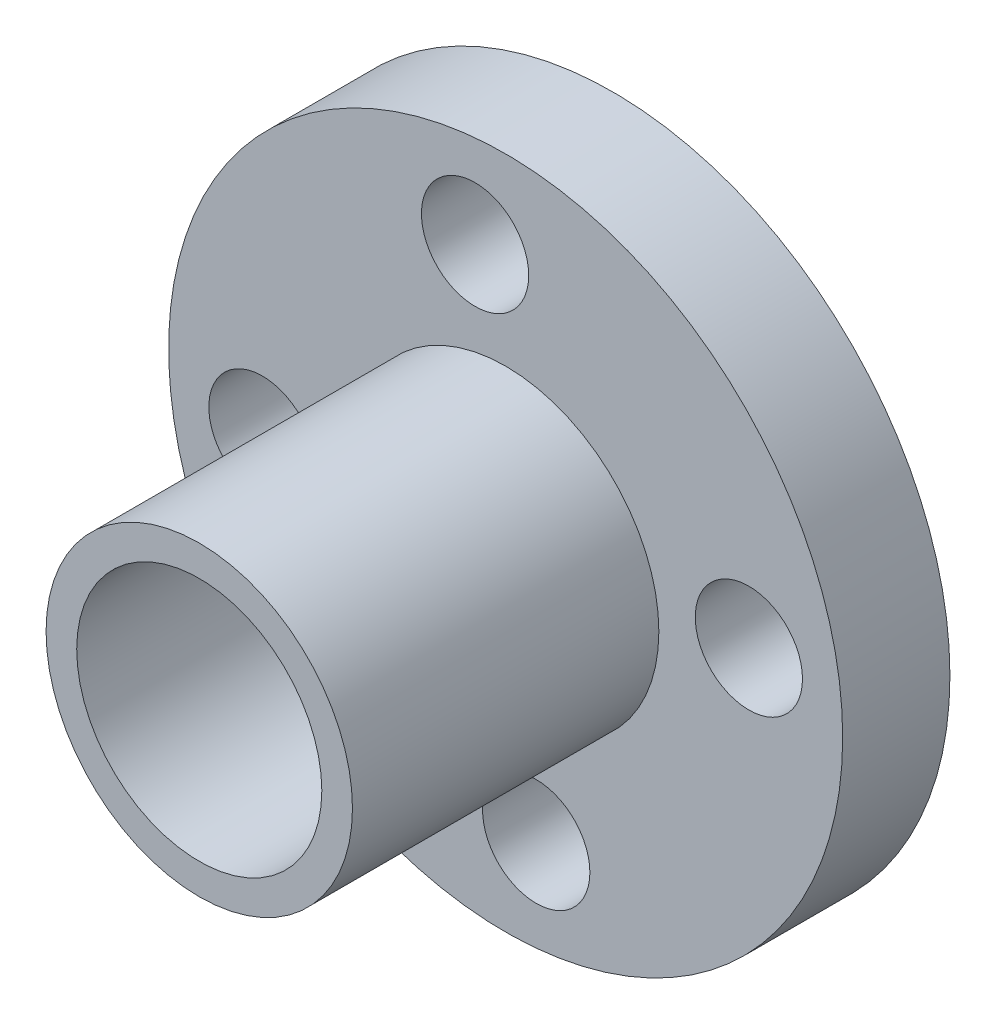
ISO-10303-21;
HEADER;
FILE_DESCRIPTION(('STEP AP214'),'2;1');
FILE_NAME('part.step','',(''),(''),'','','');
FILE_SCHEMA(('AUTOMOTIVE_DESIGN { 1 0 10303 214 1 1 1 1 }'));
ENDSEC;
DATA;
#1=APPLICATION_CONTEXT('core data for automotive mechanical design processes');
#2=APPLICATION_PROTOCOL_DEFINITION('international standard','automotive_design',2000,#1);
#3=PRODUCT_CONTEXT('',#1,'mechanical');
#4=PRODUCT('Part','Part','',(#3));
#5=PRODUCT_RELATED_PRODUCT_CATEGORY('part','',(#4));
#6=PRODUCT_DEFINITION_FORMATION('','',#4);
#7=PRODUCT_DEFINITION_CONTEXT('part definition',#1,'design');
#8=PRODUCT_DEFINITION('design','',#6,#7);
#9=PRODUCT_DEFINITION_SHAPE('','',#8);
#10=(LENGTH_UNIT() NAMED_UNIT(*) SI_UNIT(.MILLI.,.METRE.));
#11=(NAMED_UNIT(*) PLANE_ANGLE_UNIT() SI_UNIT($,.RADIAN.));
#12=(NAMED_UNIT(*) SI_UNIT($,.STERADIAN.) SOLID_ANGLE_UNIT());
#13=UNCERTAINTY_MEASURE_WITH_UNIT(LENGTH_MEASURE(1.E-05),#10,'distance_accuracy_value','');
#14=(GEOMETRIC_REPRESENTATION_CONTEXT(3) GLOBAL_UNCERTAINTY_ASSIGNED_CONTEXT((#13)) GLOBAL_UNIT_ASSIGNED_CONTEXT((#10,
#11,#12)) REPRESENTATION_CONTEXT('',''));
#15=CARTESIAN_POINT('',(0.,0.,0.));
#16=DIRECTION('',(0.,0.,1.));
#17=DIRECTION('',(1.,0.,0.));
#18=AXIS2_PLACEMENT_3D('',#15,#16,#17);
#19=CARTESIAN_POINT('',(0.,0.,3.5));
#20=DIRECTION('',(0.,0.,-1.));
#21=DIRECTION('',(-1.,0.,0.));
#22=AXIS2_PLACEMENT_3D('',#19,#20,#21);
#23=CYLINDRICAL_SURFACE('',#22,11.);
#24=CARTESIAN_POINT('',(0.,0.,3.5));
#25=DIRECTION('',(0.,0.,1.));
#26=DIRECTION('',(1.,0.,0.));
#27=AXIS2_PLACEMENT_3D('',#24,#25,#26);
#28=CIRCLE('',#27,11.);
#29=CARTESIAN_POINT('',(11.,0.,3.5));
#30=VERTEX_POINT('',#29);
#31=EDGE_CURVE('E45',#30,#30,#28,.T.);
#32=ORIENTED_EDGE('',*,*,#31,.F.);
#33=EDGE_LOOP('',(#32));
#34=FACE_BOUND('',#33,.T.);
#35=CARTESIAN_POINT('',(0.,0.,0.));
#36=DIRECTION('',(0.,0.,1.));
#37=DIRECTION('',(1.,0.,0.));
#38=AXIS2_PLACEMENT_3D('',#35,#36,#37);
#39=CIRCLE('',#38,11.);
#40=CARTESIAN_POINT('',(11.,0.,0.));
#41=VERTEX_POINT('',#40);
#42=EDGE_CURVE('E50',#41,#41,#39,.T.);
#43=ORIENTED_EDGE('',*,*,#42,.T.);
#44=EDGE_LOOP('',(#43));
#45=FACE_BOUND('',#44,.T.);
#46=ADVANCED_FACE('F38',(#34,#45),#23,.T.);
#47=CARTESIAN_POINT('',(0.,0.,3.5));
#48=DIRECTION('',(0.,0.,1.));
#49=DIRECTION('',(1.,0.,0.));
#50=AXIS2_PLACEMENT_3D('',#47,#48,#49);
#51=PLANE('',#50);
#52=CARTESIAN_POINT('',(-0.998679344714065,7.93742020850865,3.5));
#53=DIRECTION('',(0.,0.,1.));
#54=DIRECTION('',(1.,0.,0.));
#55=AXIS2_PLACEMENT_3D('',#52,#53,#54);
#56=CIRCLE('',#55,1.75);
#57=CARTESIAN_POINT('',(0.751320655285935,7.93742020850865,3.5));
#58=VERTEX_POINT('',#57);
#59=EDGE_CURVE('E65',#58,#58,#56,.T.);
#60=ORIENTED_EDGE('',*,*,#59,.F.);
#61=EDGE_LOOP('',(#60));
#62=FACE_BOUND('',#61,.T.);
#63=CARTESIAN_POINT('',(7.93742020850865,0.998679344714037,3.5));
#64=DIRECTION('',(0.,0.,1.));
#65=DIRECTION('',(1.,0.,0.));
#66=AXIS2_PLACEMENT_3D('',#63,#64,#65);
#67=CIRCLE('',#66,1.75);
#68=CARTESIAN_POINT('',(9.68742020850865,0.998679344714037,3.5));
#69=VERTEX_POINT('',#68);
#70=EDGE_CURVE('E155',#69,#69,#67,.T.);
#71=ORIENTED_EDGE('',*,*,#70,.F.);
#72=EDGE_LOOP('',(#71));
#73=FACE_BOUND('',#72,.T.);
#74=CARTESIAN_POINT('',(0.998679344714009,-7.93742020850866,3.5));
#75=DIRECTION('',(0.,0.,1.));
#76=DIRECTION('',(1.,0.,0.));
#77=AXIS2_PLACEMENT_3D('',#74,#75,#76);
#78=CIRCLE('',#77,1.75);
#79=CARTESIAN_POINT('',(2.74867934471401,-7.93742020850866,3.5));
#80=VERTEX_POINT('',#79);
#81=EDGE_CURVE('E158',#80,#80,#78,.T.);
#82=ORIENTED_EDGE('',*,*,#81,.F.);
#83=EDGE_LOOP('',(#82));
#84=FACE_BOUND('',#83,.T.);
#85=CARTESIAN_POINT('',(-7.93742020850866,-0.998679344713982,3.5));
#86=DIRECTION('',(0.,0.,1.));
#87=DIRECTION('',(1.,0.,0.));
#88=AXIS2_PLACEMENT_3D('',#85,#86,#87);
#89=CIRCLE('',#88,1.75);
#90=CARTESIAN_POINT('',(-6.18742020850866,-0.998679344713982,3.5));
#91=VERTEX_POINT('',#90);
#92=EDGE_CURVE('E162',#91,#91,#89,.T.);
#93=ORIENTED_EDGE('',*,*,#92,.F.);
#94=EDGE_LOOP('',(#93));
#95=FACE_BOUND('',#94,.T.);
#96=CARTESIAN_POINT('',(0.,0.,3.5));
#97=DIRECTION('',(0.,0.,1.));
#98=DIRECTION('',(1.,0.,0.));
#99=AXIS2_PLACEMENT_3D('',#96,#97,#98);
#100=CIRCLE('',#99,5.);
#101=CARTESIAN_POINT('',(5.,0.,3.5));
#102=VERTEX_POINT('',#101);
#103=EDGE_CURVE('E10',#102,#102,#100,.T.);
#104=ORIENTED_EDGE('',*,*,#103,.F.);
#105=EDGE_LOOP('',(#104));
#106=FACE_BOUND('',#105,.T.);
#107=ORIENTED_EDGE('',*,*,#31,.T.);
#108=EDGE_LOOP('',(#107));
#109=FACE_BOUND('',#108,.T.);
#110=ADVANCED_FACE('F104',(#62,#73,#84,#95,#106,#109),#51,.T.);
#111=CARTESIAN_POINT('',(0.,0.,0.));
#112=DIRECTION('',(0.,0.,1.));
#113=DIRECTION('',(1.,0.,0.));
#114=AXIS2_PLACEMENT_3D('',#111,#112,#113);
#115=PLANE('',#114);
#116=CARTESIAN_POINT('',(-0.998679344714065,7.93742020850865,0.));
#117=DIRECTION('',(0.,0.,1.));
#118=DIRECTION('',(1.,0.,0.));
#119=AXIS2_PLACEMENT_3D('',#116,#117,#118);
#120=CIRCLE('',#119,1.75);
#121=CARTESIAN_POINT('',(0.751320655285935,7.93742020850865,0.));
#122=VERTEX_POINT('',#121);
#123=EDGE_CURVE('E41',#122,#122,#120,.T.);
#124=ORIENTED_EDGE('',*,*,#123,.T.);
#125=EDGE_LOOP('',(#124));
#126=FACE_BOUND('',#125,.T.);
#127=CARTESIAN_POINT('',(7.93742020850865,0.998679344714037,0.));
#128=DIRECTION('',(0.,0.,1.));
#129=DIRECTION('',(1.,0.,0.));
#130=AXIS2_PLACEMENT_3D('',#127,#128,#129);
#131=CIRCLE('',#130,1.75);
#132=CARTESIAN_POINT('',(9.68742020850865,0.998679344714037,0.));
#133=VERTEX_POINT('',#132);
#134=EDGE_CURVE('E67',#133,#133,#131,.T.);
#135=ORIENTED_EDGE('',*,*,#134,.T.);
#136=EDGE_LOOP('',(#135));
#137=FACE_BOUND('',#136,.T.);
#138=CARTESIAN_POINT('',(0.998679344714009,-7.93742020850866,0.));
#139=DIRECTION('',(0.,0.,1.));
#140=DIRECTION('',(1.,0.,0.));
#141=AXIS2_PLACEMENT_3D('',#138,#139,#140);
#142=CIRCLE('',#141,1.75);
#143=CARTESIAN_POINT('',(2.74867934471401,-7.93742020850866,0.));
#144=VERTEX_POINT('',#143);
#145=EDGE_CURVE('E64',#144,#144,#142,.T.);
#146=ORIENTED_EDGE('',*,*,#145,.T.);
#147=EDGE_LOOP('',(#146));
#148=FACE_BOUND('',#147,.T.);
#149=CARTESIAN_POINT('',(-7.93742020850866,-0.998679344713982,0.));
#150=DIRECTION('',(0.,0.,1.));
#151=DIRECTION('',(1.,0.,0.));
#152=AXIS2_PLACEMENT_3D('',#149,#150,#151);
#153=CIRCLE('',#152,1.75);
#154=CARTESIAN_POINT('',(-6.18742020850866,-0.998679344713982,0.));
#155=VERTEX_POINT('',#154);
#156=EDGE_CURVE('E61',#155,#155,#153,.T.);
#157=ORIENTED_EDGE('',*,*,#156,.T.);
#158=EDGE_LOOP('',(#157));
#159=FACE_BOUND('',#158,.T.);
#160=CARTESIAN_POINT('',(0.,0.,0.));
#161=DIRECTION('',(0.,0.,1.));
#162=DIRECTION('',(1.,0.,0.));
#163=AXIS2_PLACEMENT_3D('',#160,#161,#162);
#164=CIRCLE('',#163,5.);
#165=CARTESIAN_POINT('',(5.,0.,0.));
#166=VERTEX_POINT('',#165);
#167=EDGE_CURVE('E58',#166,#166,#164,.T.);
#168=ORIENTED_EDGE('',*,*,#167,.T.);
#169=EDGE_LOOP('',(#168));
#170=FACE_BOUND('',#169,.T.);
#171=ORIENTED_EDGE('',*,*,#42,.F.);
#172=EDGE_LOOP('',(#171));
#173=FACE_BOUND('',#172,.T.);
#174=ADVANCED_FACE('F95',(#126,#137,#148,#159,#170,#173),#115,.F.);
#175=CARTESIAN_POINT('',(0.,0.,-1.5));
#176=DIRECTION('',(0.,0.,1.));
#177=DIRECTION('',(1.,0.,0.));
#178=AXIS2_PLACEMENT_3D('',#175,#176,#177);
#179=PLANE('',#178);
#180=CARTESIAN_POINT('',(0.,0.,-1.5));
#181=DIRECTION('',(0.,0.,1.));
#182=DIRECTION('',(1.,0.,0.));
#183=AXIS2_PLACEMENT_3D('',#180,#181,#182);
#184=CIRCLE('',#183,4.);
#185=CARTESIAN_POINT('',(4.,0.,-1.5));
#186=VERTEX_POINT('',#185);
#187=EDGE_CURVE('E76',#186,#186,#184,.T.);
#188=ORIENTED_EDGE('',*,*,#187,.T.);
#189=EDGE_LOOP('',(#188));
#190=FACE_BOUND('',#189,.T.);
#191=CARTESIAN_POINT('',(0.,0.,-1.5));
#192=DIRECTION('',(0.,0.,1.));
#193=DIRECTION('',(1.,0.,0.));
#194=AXIS2_PLACEMENT_3D('',#191,#192,#193);
#195=CIRCLE('',#194,5.);
#196=CARTESIAN_POINT('',(5.,0.,-1.5));
#197=VERTEX_POINT('',#196);
#198=EDGE_CURVE('E53',#197,#197,#195,.T.);
#199=ORIENTED_EDGE('',*,*,#198,.F.);
#200=EDGE_LOOP('',(#199));
#201=FACE_BOUND('',#200,.T.);
#202=ADVANCED_FACE('F93',(#190,#201),#179,.F.);
#203=CARTESIAN_POINT('',(0.,0.,-1.5));
#204=DIRECTION('',(0.,0.,1.));
#205=DIRECTION('',(1.,0.,0.));
#206=AXIS2_PLACEMENT_3D('',#203,#204,#205);
#207=CYLINDRICAL_SURFACE('',#206,5.);
#208=ORIENTED_EDGE('',*,*,#198,.T.);
#209=EDGE_LOOP('',(#208));
#210=FACE_BOUND('',#209,.T.);
#211=ORIENTED_EDGE('',*,*,#167,.F.);
#212=EDGE_LOOP('',(#211));
#213=FACE_BOUND('',#212,.T.);
#214=ADVANCED_FACE('F90',(#210,#213),#207,.T.);
#215=ORIENTED_EDGE('',*,*,#103,.T.);
#216=EDGE_LOOP('',(#215));
#217=FACE_BOUND('',#216,.T.);
#218=CARTESIAN_POINT('',(0.,0.,13.5));
#219=DIRECTION('',(0.,0.,1.));
#220=DIRECTION('',(1.,0.,0.));
#221=AXIS2_PLACEMENT_3D('',#218,#219,#220);
#222=CIRCLE('',#221,5.);
#223=CARTESIAN_POINT('',(5.,0.,13.5));
#224=VERTEX_POINT('',#223);
#225=EDGE_CURVE('E81',#224,#224,#222,.T.);
#226=ORIENTED_EDGE('',*,*,#225,.F.);
#227=EDGE_LOOP('',(#226));
#228=FACE_BOUND('',#227,.T.);
#229=ADVANCED_FACE('F102',(#217,#228),#207,.T.);
#230=CARTESIAN_POINT('',(0.,0.,13.5));
#231=DIRECTION('',(0.,0.,1.));
#232=DIRECTION('',(1.,0.,0.));
#233=AXIS2_PLACEMENT_3D('',#230,#231,#232);
#234=PLANE('',#233);
#235=CARTESIAN_POINT('',(0.,0.,13.5));
#236=DIRECTION('',(0.,0.,1.));
#237=DIRECTION('',(1.,0.,0.));
#238=AXIS2_PLACEMENT_3D('',#235,#236,#237);
#239=CIRCLE('',#238,4.);
#240=CARTESIAN_POINT('',(4.,0.,13.5));
#241=VERTEX_POINT('',#240);
#242=EDGE_CURVE('E72',#241,#241,#239,.T.);
#243=ORIENTED_EDGE('',*,*,#242,.F.);
#244=EDGE_LOOP('',(#243));
#245=FACE_BOUND('',#244,.T.);
#246=ORIENTED_EDGE('',*,*,#225,.T.);
#247=EDGE_LOOP('',(#246));
#248=FACE_BOUND('',#247,.T.);
#249=ADVANCED_FACE('F123',(#245,#248),#234,.T.);
#250=CARTESIAN_POINT('',(0.,0.,-1.5));
#251=DIRECTION('',(0.,0.,1.));
#252=DIRECTION('',(1.,0.,0.));
#253=AXIS2_PLACEMENT_3D('',#250,#251,#252);
#254=CYLINDRICAL_SURFACE('',#253,4.);
#255=ORIENTED_EDGE('',*,*,#187,.F.);
#256=EDGE_LOOP('',(#255));
#257=FACE_BOUND('',#256,.T.);
#258=ORIENTED_EDGE('',*,*,#242,.T.);
#259=EDGE_LOOP('',(#258));
#260=FACE_BOUND('',#259,.T.);
#261=ADVANCED_FACE('F127',(#257,#260),#254,.F.);
#262=CARTESIAN_POINT('',(-7.93742020850866,-0.998679344713982,-1.5));
#263=DIRECTION('',(0.,0.,1.));
#264=DIRECTION('',(1.,0.,0.));
#265=AXIS2_PLACEMENT_3D('',#262,#263,#264);
#266=CYLINDRICAL_SURFACE('',#265,1.75);
#267=ORIENTED_EDGE('',*,*,#92,.T.);
#268=EDGE_LOOP('',(#267));
#269=FACE_BOUND('',#268,.T.);
#270=ORIENTED_EDGE('',*,*,#156,.F.);
#271=EDGE_LOOP('',(#270));
#272=FACE_BOUND('',#271,.T.);
#273=ADVANCED_FACE('F133',(#269,#272),#266,.F.);
#274=CARTESIAN_POINT('',(0.998679344714009,-7.93742020850866,-1.5));
#275=DIRECTION('',(0.,0.,1.));
#276=DIRECTION('',(1.,0.,0.));
#277=AXIS2_PLACEMENT_3D('',#274,#275,#276);
#278=CYLINDRICAL_SURFACE('',#277,1.75);
#279=ORIENTED_EDGE('',*,*,#81,.T.);
#280=EDGE_LOOP('',(#279));
#281=FACE_BOUND('',#280,.T.);
#282=ORIENTED_EDGE('',*,*,#145,.F.);
#283=EDGE_LOOP('',(#282));
#284=FACE_BOUND('',#283,.T.);
#285=ADVANCED_FACE('F139',(#281,#284),#278,.F.);
#286=CARTESIAN_POINT('',(7.93742020850865,0.998679344714037,-1.5));
#287=DIRECTION('',(0.,0.,1.));
#288=DIRECTION('',(1.,0.,0.));
#289=AXIS2_PLACEMENT_3D('',#286,#287,#288);
#290=CYLINDRICAL_SURFACE('',#289,1.75);
#291=ORIENTED_EDGE('',*,*,#70,.T.);
#292=EDGE_LOOP('',(#291));
#293=FACE_BOUND('',#292,.T.);
#294=ORIENTED_EDGE('',*,*,#134,.F.);
#295=EDGE_LOOP('',(#294));
#296=FACE_BOUND('',#295,.T.);
#297=ADVANCED_FACE('F143',(#293,#296),#290,.F.);
#298=CARTESIAN_POINT('',(-0.998679344714065,7.93742020850865,-1.5));
#299=DIRECTION('',(0.,0.,1.));
#300=DIRECTION('',(1.,0.,0.));
#301=AXIS2_PLACEMENT_3D('',#298,#299,#300);
#302=CYLINDRICAL_SURFACE('',#301,1.75);
#303=ORIENTED_EDGE('',*,*,#59,.T.);
#304=EDGE_LOOP('',(#303));
#305=FACE_BOUND('',#304,.T.);
#306=ORIENTED_EDGE('',*,*,#123,.F.);
#307=EDGE_LOOP('',(#306));
#308=FACE_BOUND('',#307,.T.);
#309=ADVANCED_FACE('F147',(#305,#308),#302,.F.);
#310=CLOSED_SHELL('',(#46,#110,#174,#202,#214,#229,#249,#261,#273,#285,#297,#309));
#311=MANIFOLD_SOLID_BREP('B2',#310);
#312=ADVANCED_BREP_SHAPE_REPRESENTATION('',(#18,#311),#14);
#313=SHAPE_DEFINITION_REPRESENTATION(#9,#312);
ENDSEC;
END-ISO-10303-21;
